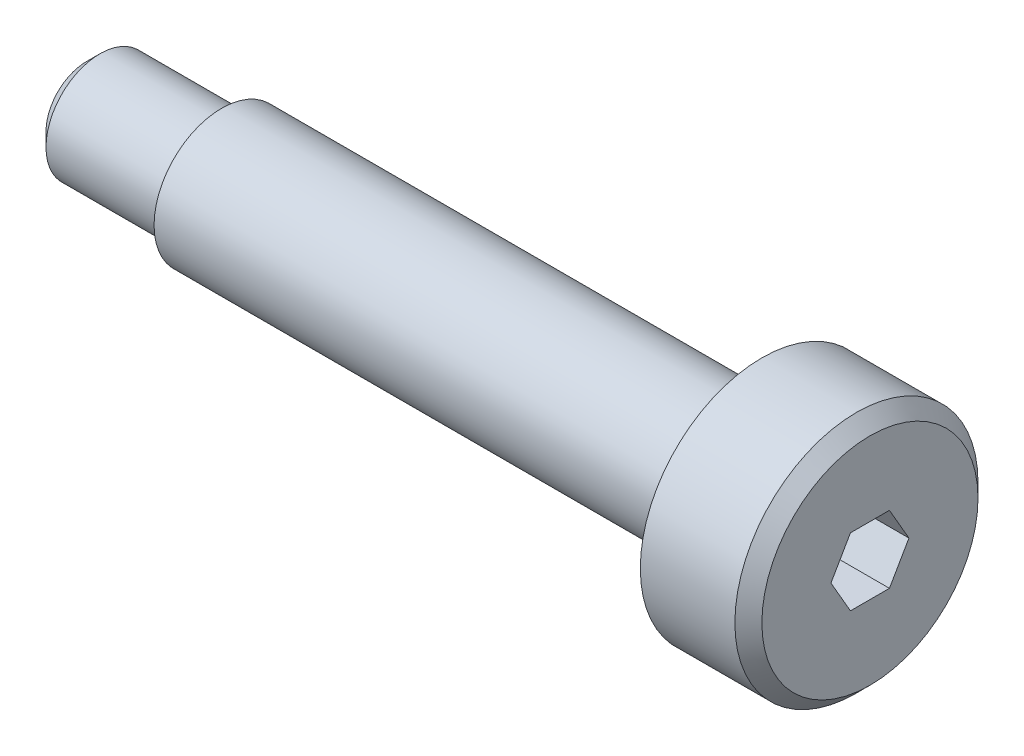
ISO-10303-21;
HEADER;
FILE_DESCRIPTION(('STEP AP214'),'2;1');
FILE_NAME('part.step','',(''),(''),'','','');
FILE_SCHEMA(('AUTOMOTIVE_DESIGN { 1 0 10303 214 1 1 1 1 }'));
ENDSEC;
DATA;
#1=APPLICATION_CONTEXT('core data for automotive mechanical design processes');
#2=APPLICATION_PROTOCOL_DEFINITION('international standard','automotive_design',2000,#1);
#3=PRODUCT_CONTEXT('',#1,'mechanical');
#4=PRODUCT('Part','Part','',(#3));
#5=PRODUCT_RELATED_PRODUCT_CATEGORY('part','',(#4));
#6=PRODUCT_DEFINITION_FORMATION('','',#4);
#7=PRODUCT_DEFINITION_CONTEXT('part definition',#1,'design');
#8=PRODUCT_DEFINITION('design','',#6,#7);
#9=PRODUCT_DEFINITION_SHAPE('','',#8);
#10=(LENGTH_UNIT() NAMED_UNIT(*) SI_UNIT(.MILLI.,.METRE.));
#11=(NAMED_UNIT(*) PLANE_ANGLE_UNIT() SI_UNIT($,.RADIAN.));
#12=(NAMED_UNIT(*) SI_UNIT($,.STERADIAN.) SOLID_ANGLE_UNIT());
#13=UNCERTAINTY_MEASURE_WITH_UNIT(LENGTH_MEASURE(1.E-05),#10,'distance_accuracy_value','');
#14=(GEOMETRIC_REPRESENTATION_CONTEXT(3) GLOBAL_UNCERTAINTY_ASSIGNED_CONTEXT((#13)) GLOBAL_UNIT_ASSIGNED_CONTEXT((#10,
#11,#12)) REPRESENTATION_CONTEXT('',''));
#15=CARTESIAN_POINT('',(0.,0.,0.));
#16=DIRECTION('',(0.,0.,1.));
#17=DIRECTION('',(1.,0.,0.));
#18=AXIS2_PLACEMENT_3D('',#15,#16,#17);
#19=CARTESIAN_POINT('',(0.,1.5,0.));
#20=DIRECTION('',(1.,0.,0.));
#21=DIRECTION('',(0.,0.,-1.));
#22=AXIS2_PLACEMENT_3D('',#19,#20,#21);
#23=PLANE('',#22);
#24=CARTESIAN_POINT('',(0.,0.,0.));
#25=DIRECTION('',(-1.,0.,0.));
#26=DIRECTION('',(0.,0.,1.));
#27=AXIS2_PLACEMENT_3D('',#24,#25,#26);
#28=CIRCLE('',#27,1.5);
#29=CARTESIAN_POINT('',(0.,0.,1.5));
#30=VERTEX_POINT('',#29);
#31=EDGE_CURVE('E159',#30,#30,#28,.T.);
#32=ORIENTED_EDGE('',*,*,#31,.T.);
#33=EDGE_LOOP('',(#32));
#34=FACE_BOUND('',#33,.T.);
#35=ADVANCED_FACE('F45',(#34),#23,.F.);
#36=CARTESIAN_POINT('',(29.,0.,0.));
#37=DIRECTION('',(-1.,0.,0.));
#38=DIRECTION('',(0.,0.,1.));
#39=AXIS2_PLACEMENT_3D('',#36,#37,#38);
#40=PLANE('',#39);
#41=DIRECTION('',(0.,0.866025403784438,0.5));
#42=VECTOR('',#41,1.);
#43=CARTESIAN_POINT('',(29.,0.,-1.44337567297407));
#44=LINE('',#43,#42);
#45=CARTESIAN_POINT('',(29.,0.,-1.44337567297407));
#46=VERTEX_POINT('',#45);
#47=CARTESIAN_POINT('',(29.,1.25,-0.721687836487032));
#48=VERTEX_POINT('',#47);
#49=EDGE_CURVE('E140',#46,#48,#44,.T.);
#50=ORIENTED_EDGE('',*,*,#49,.F.);
#51=DIRECTION('',(0.,0.866025403784439,-0.5));
#52=VECTOR('',#51,1.);
#53=CARTESIAN_POINT('',(29.,-1.25,-0.721687836487033));
#54=LINE('',#53,#52);
#55=CARTESIAN_POINT('',(29.,-1.25,-0.721687836487033));
#56=VERTEX_POINT('',#55);
#57=EDGE_CURVE('E60',#56,#46,#54,.T.);
#58=ORIENTED_EDGE('',*,*,#57,.F.);
#59=DIRECTION('',(0.,0.,-1.));
#60=VECTOR('',#59,1.);
#61=CARTESIAN_POINT('',(29.,-1.25,0.721687836487031));
#62=LINE('',#61,#60);
#63=CARTESIAN_POINT('',(29.,-1.25,0.721687836487031));
#64=VERTEX_POINT('',#63);
#65=EDGE_CURVE('E153',#64,#56,#62,.T.);
#66=ORIENTED_EDGE('',*,*,#65,.F.);
#67=DIRECTION('',(0.,-0.866025403784438,-0.5));
#68=VECTOR('',#67,1.);
#69=CARTESIAN_POINT('',(29.,0.,1.44337567297406));
#70=LINE('',#69,#68);
#71=CARTESIAN_POINT('',(29.,0.,1.44337567297406));
#72=VERTEX_POINT('',#71);
#73=EDGE_CURVE('E150',#72,#64,#70,.T.);
#74=ORIENTED_EDGE('',*,*,#73,.F.);
#75=DIRECTION('',(0.,-0.866025403784438,0.5));
#76=VECTOR('',#75,1.);
#77=CARTESIAN_POINT('',(29.,1.25,0.721687836487031));
#78=LINE('',#77,#76);
#79=CARTESIAN_POINT('',(29.,1.25,0.721687836487031));
#80=VERTEX_POINT('',#79);
#81=EDGE_CURVE('E108',#80,#72,#78,.T.);
#82=ORIENTED_EDGE('',*,*,#81,.F.);
#83=DIRECTION('',(0.,0.,1.));
#84=VECTOR('',#83,1.);
#85=CARTESIAN_POINT('',(29.,1.25,-0.721687836487032));
#86=LINE('',#85,#84);
#87=EDGE_CURVE('E144',#48,#80,#86,.T.);
#88=ORIENTED_EDGE('',*,*,#87,.F.);
#89=EDGE_LOOP('',(#50,#58,#66,#74,#82,#88));
#90=FACE_BOUND('',#89,.T.);
#91=CARTESIAN_POINT('',(29.,0.,0.));
#92=DIRECTION('',(-1.,0.,0.));
#93=DIRECTION('',(0.,0.,1.));
#94=AXIS2_PLACEMENT_3D('',#91,#92,#93);
#95=CIRCLE('',#94,4.);
#96=CARTESIAN_POINT('',(29.,0.,4.));
#97=VERTEX_POINT('',#96);
#98=EDGE_CURVE('E11',#97,#97,#95,.T.);
#99=ORIENTED_EDGE('',*,*,#98,.F.);
#100=EDGE_LOOP('',(#99));
#101=FACE_BOUND('',#100,.T.);
#102=ADVANCED_FACE('F200',(#90,#101),#40,.F.);
#103=CARTESIAN_POINT('',(29.,0.,0.));
#104=DIRECTION('',(-1.,0.,0.));
#105=DIRECTION('',(0.,0.,1.));
#106=AXIS2_PLACEMENT_3D('',#103,#104,#105);
#107=CONICAL_SURFACE('',#106,4.,0.785398163397451);
#108=CARTESIAN_POINT('',(28.5,0.,0.));
#109=DIRECTION('',(-1.,0.,0.));
#110=DIRECTION('',(0.,0.,1.));
#111=AXIS2_PLACEMENT_3D('',#108,#109,#110);
#112=CIRCLE('',#111,4.5);
#113=CARTESIAN_POINT('',(28.5,0.,4.5));
#114=VERTEX_POINT('',#113);
#115=EDGE_CURVE('E53',#114,#114,#112,.T.);
#116=ORIENTED_EDGE('',*,*,#115,.F.);
#117=EDGE_LOOP('',(#116));
#118=FACE_BOUND('',#117,.T.);
#119=ORIENTED_EDGE('',*,*,#98,.T.);
#120=EDGE_LOOP('',(#119));
#121=FACE_BOUND('',#120,.T.);
#122=ADVANCED_FACE('F197',(#118,#121),#107,.T.);
#123=CARTESIAN_POINT('',(0.,0.,0.));
#124=DIRECTION('',(-1.,0.,0.));
#125=DIRECTION('',(0.,0.,1.));
#126=AXIS2_PLACEMENT_3D('',#123,#124,#125);
#127=CYLINDRICAL_SURFACE('',#126,4.5);
#128=CARTESIAN_POINT('',(25.,0.,0.));
#129=DIRECTION('',(-1.,0.,0.));
#130=DIRECTION('',(0.,0.,1.));
#131=AXIS2_PLACEMENT_3D('',#128,#129,#130);
#132=CIRCLE('',#131,4.5);
#133=CARTESIAN_POINT('',(25.,0.,4.5));
#134=VERTEX_POINT('',#133);
#135=EDGE_CURVE('E188',#134,#134,#132,.T.);
#136=ORIENTED_EDGE('',*,*,#135,.F.);
#137=EDGE_LOOP('',(#136));
#138=FACE_BOUND('',#137,.T.);
#139=ORIENTED_EDGE('',*,*,#115,.T.);
#140=EDGE_LOOP('',(#139));
#141=FACE_BOUND('',#140,.T.);
#142=ADVANCED_FACE('F195',(#138,#141),#127,.T.);
#143=CARTESIAN_POINT('',(25.,4.5,0.));
#144=DIRECTION('',(1.,0.,0.));
#145=DIRECTION('',(0.,0.,-1.));
#146=AXIS2_PLACEMENT_3D('',#143,#144,#145);
#147=PLANE('',#146);
#148=CARTESIAN_POINT('',(25.,0.,0.));
#149=DIRECTION('',(-1.,0.,0.));
#150=DIRECTION('',(0.,0.,1.));
#151=AXIS2_PLACEMENT_3D('',#148,#149,#150);
#152=CIRCLE('',#151,2.5);
#153=CARTESIAN_POINT('',(25.,0.,2.5));
#154=VERTEX_POINT('',#153);
#155=EDGE_CURVE('E184',#154,#154,#152,.T.);
#156=ORIENTED_EDGE('',*,*,#155,.F.);
#157=EDGE_LOOP('',(#156));
#158=FACE_BOUND('',#157,.T.);
#159=ORIENTED_EDGE('',*,*,#135,.T.);
#160=EDGE_LOOP('',(#159));
#161=FACE_BOUND('',#160,.T.);
#162=ADVANCED_FACE('F216',(#158,#161),#147,.F.);
#163=CARTESIAN_POINT('',(0.,0.,0.));
#164=DIRECTION('',(-1.,0.,0.));
#165=DIRECTION('',(0.,0.,1.));
#166=AXIS2_PLACEMENT_3D('',#163,#164,#165);
#167=CYLINDRICAL_SURFACE('',#166,2.5);
#168=CARTESIAN_POINT('',(5.,0.,0.));
#169=DIRECTION('',(-1.,0.,0.));
#170=DIRECTION('',(0.,0.,1.));
#171=AXIS2_PLACEMENT_3D('',#168,#169,#170);
#172=CIRCLE('',#171,2.5);
#173=CARTESIAN_POINT('',(5.,0.,2.5));
#174=VERTEX_POINT('',#173);
#175=EDGE_CURVE('E180',#174,#174,#172,.T.);
#176=ORIENTED_EDGE('',*,*,#175,.F.);
#177=EDGE_LOOP('',(#176));
#178=FACE_BOUND('',#177,.T.);
#179=ORIENTED_EDGE('',*,*,#155,.T.);
#180=EDGE_LOOP('',(#179));
#181=FACE_BOUND('',#180,.T.);
#182=ADVANCED_FACE('F220',(#178,#181),#167,.T.);
#183=CARTESIAN_POINT('',(5.,2.5,0.));
#184=DIRECTION('',(1.,0.,0.));
#185=DIRECTION('',(0.,0.,-1.));
#186=AXIS2_PLACEMENT_3D('',#183,#184,#185);
#187=PLANE('',#186);
#188=CARTESIAN_POINT('',(5.,0.,0.));
#189=DIRECTION('',(-1.,0.,0.));
#190=DIRECTION('',(0.,0.,1.));
#191=AXIS2_PLACEMENT_3D('',#188,#189,#190);
#192=CIRCLE('',#191,2.);
#193=CARTESIAN_POINT('',(5.,0.,2.));
#194=VERTEX_POINT('',#193);
#195=EDGE_CURVE('E176',#194,#194,#192,.T.);
#196=ORIENTED_EDGE('',*,*,#195,.F.);
#197=EDGE_LOOP('',(#196));
#198=FACE_BOUND('',#197,.T.);
#199=ORIENTED_EDGE('',*,*,#175,.T.);
#200=EDGE_LOOP('',(#199));
#201=FACE_BOUND('',#200,.T.);
#202=ADVANCED_FACE('F224',(#198,#201),#187,.F.);
#203=CARTESIAN_POINT('',(0.,0.,0.));
#204=DIRECTION('',(-1.,0.,0.));
#205=DIRECTION('',(0.,0.,1.));
#206=AXIS2_PLACEMENT_3D('',#203,#204,#205);
#207=CYLINDRICAL_SURFACE('',#206,2.);
#208=CARTESIAN_POINT('',(0.5,0.,0.));
#209=DIRECTION('',(-1.,0.,0.));
#210=DIRECTION('',(0.,0.,1.));
#211=AXIS2_PLACEMENT_3D('',#208,#209,#210);
#212=CIRCLE('',#211,2.);
#213=CARTESIAN_POINT('',(0.5,0.,2.));
#214=VERTEX_POINT('',#213);
#215=EDGE_CURVE('E172',#214,#214,#212,.T.);
#216=ORIENTED_EDGE('',*,*,#215,.F.);
#217=EDGE_LOOP('',(#216));
#218=FACE_BOUND('',#217,.T.);
#219=ORIENTED_EDGE('',*,*,#195,.T.);
#220=EDGE_LOOP('',(#219));
#221=FACE_BOUND('',#220,.T.);
#222=ADVANCED_FACE('F228',(#218,#221),#207,.T.);
#223=CARTESIAN_POINT('',(0.5,0.,0.));
#224=DIRECTION('',(1.,0.,0.));
#225=DIRECTION('',(0.,0.,-1.));
#226=AXIS2_PLACEMENT_3D('',#223,#224,#225);
#227=CONICAL_SURFACE('',#226,2.,0.785398163397448);
#228=ORIENTED_EDGE('',*,*,#31,.F.);
#229=EDGE_LOOP('',(#228));
#230=FACE_BOUND('',#229,.T.);
#231=ORIENTED_EDGE('',*,*,#215,.T.);
#232=EDGE_LOOP('',(#231));
#233=FACE_BOUND('',#232,.T.);
#234=ADVANCED_FACE('F232',(#230,#233),#227,.T.);
#235=CARTESIAN_POINT('',(25.,-1.25,-0.721687836487033));
#236=DIRECTION('',(0.,-0.5,-0.866025403784439));
#237=DIRECTION('',(0.,0.866025403784439,-0.5));
#238=AXIS2_PLACEMENT_3D('',#235,#236,#237);
#239=PLANE('',#238);
#240=ORIENTED_EDGE('',*,*,#57,.T.);
#241=DIRECTION('',(1.,0.,0.));
#242=VECTOR('',#241,1.);
#243=CARTESIAN_POINT('',(25.,0.,-1.44337567297407));
#244=LINE('',#243,#242);
#245=CARTESIAN_POINT('',(25.,0.,-1.44337567297407));
#246=VERTEX_POINT('',#245);
#247=EDGE_CURVE('E90',#246,#46,#244,.T.);
#248=ORIENTED_EDGE('',*,*,#247,.F.);
#249=DIRECTION('',(0.,0.866025403784439,-0.5));
#250=VECTOR('',#249,1.);
#251=CARTESIAN_POINT('',(25.,-1.25,-0.721687836487033));
#252=LINE('',#251,#250);
#253=CARTESIAN_POINT('',(25.,-1.25,-0.721687836487033));
#254=VERTEX_POINT('',#253);
#255=EDGE_CURVE('E156',#254,#246,#252,.T.);
#256=ORIENTED_EDGE('',*,*,#255,.F.);
#257=DIRECTION('',(1.,0.,0.));
#258=VECTOR('',#257,1.);
#259=CARTESIAN_POINT('',(25.,-1.25,-0.721687836487033));
#260=LINE('',#259,#258);
#261=EDGE_CURVE('E68',#254,#56,#260,.T.);
#262=ORIENTED_EDGE('',*,*,#261,.T.);
#263=EDGE_LOOP('',(#240,#248,#256,#262));
#264=FACE_BOUND('',#263,.T.);
#265=ADVANCED_FACE('F235',(#264),#239,.F.);
#266=CARTESIAN_POINT('',(25.,-1.25,0.721687836487031));
#267=DIRECTION('',(0.,-1.,0.));
#268=DIRECTION('',(0.,0.,-1.));
#269=AXIS2_PLACEMENT_3D('',#266,#267,#268);
#270=PLANE('',#269);
#271=ORIENTED_EDGE('',*,*,#65,.T.);
#272=ORIENTED_EDGE('',*,*,#261,.F.);
#273=DIRECTION('',(0.,0.,-1.));
#274=VECTOR('',#273,1.);
#275=CARTESIAN_POINT('',(25.,-1.25,0.721687836487031));
#276=LINE('',#275,#274);
#277=CARTESIAN_POINT('',(25.,-1.25,0.721687836487031));
#278=VERTEX_POINT('',#277);
#279=EDGE_CURVE('E122',#278,#254,#276,.T.);
#280=ORIENTED_EDGE('',*,*,#279,.F.);
#281=DIRECTION('',(1.,0.,0.));
#282=VECTOR('',#281,1.);
#283=CARTESIAN_POINT('',(25.,-1.25,0.721687836487031));
#284=LINE('',#283,#282);
#285=EDGE_CURVE('E113',#278,#64,#284,.T.);
#286=ORIENTED_EDGE('',*,*,#285,.T.);
#287=EDGE_LOOP('',(#271,#272,#280,#286));
#288=FACE_BOUND('',#287,.T.);
#289=ADVANCED_FACE('F238',(#288),#270,.F.);
#290=CARTESIAN_POINT('',(25.,0.,1.44337567297406));
#291=DIRECTION('',(0.,-0.5,0.866025403784438));
#292=DIRECTION('',(0.,-0.866025403784438,-0.5));
#293=AXIS2_PLACEMENT_3D('',#290,#291,#292);
#294=PLANE('',#293);
#295=ORIENTED_EDGE('',*,*,#73,.T.);
#296=ORIENTED_EDGE('',*,*,#285,.F.);
#297=DIRECTION('',(0.,-0.866025403784438,-0.5));
#298=VECTOR('',#297,1.);
#299=CARTESIAN_POINT('',(25.,0.,1.44337567297406));
#300=LINE('',#299,#298);
#301=CARTESIAN_POINT('',(25.,0.,1.44337567297406));
#302=VERTEX_POINT('',#301);
#303=EDGE_CURVE('E117',#302,#278,#300,.T.);
#304=ORIENTED_EDGE('',*,*,#303,.F.);
#305=DIRECTION('',(1.,0.,0.));
#306=VECTOR('',#305,1.);
#307=CARTESIAN_POINT('',(25.,0.,1.44337567297406));
#308=LINE('',#307,#306);
#309=EDGE_CURVE('E101',#302,#72,#308,.T.);
#310=ORIENTED_EDGE('',*,*,#309,.T.);
#311=EDGE_LOOP('',(#295,#296,#304,#310));
#312=FACE_BOUND('',#311,.T.);
#313=ADVANCED_FACE('F118',(#312),#294,.F.);
#314=CARTESIAN_POINT('',(25.,1.25,0.721687836487031));
#315=DIRECTION('',(0.,0.5,0.866025403784439));
#316=DIRECTION('',(0.,-0.866025403784438,0.5));
#317=AXIS2_PLACEMENT_3D('',#314,#315,#316);
#318=PLANE('',#317);
#319=ORIENTED_EDGE('',*,*,#81,.T.);
#320=ORIENTED_EDGE('',*,*,#309,.F.);
#321=DIRECTION('',(0.,-0.866025403784438,0.5));
#322=VECTOR('',#321,1.);
#323=CARTESIAN_POINT('',(25.,1.25,0.721687836487031));
#324=LINE('',#323,#322);
#325=CARTESIAN_POINT('',(25.,1.25,0.721687836487031));
#326=VERTEX_POINT('',#325);
#327=EDGE_CURVE('E105',#326,#302,#324,.T.);
#328=ORIENTED_EDGE('',*,*,#327,.F.);
#329=DIRECTION('',(1.,0.,0.));
#330=VECTOR('',#329,1.);
#331=CARTESIAN_POINT('',(25.,1.25,0.721687836487031));
#332=LINE('',#331,#330);
#333=EDGE_CURVE('E114',#326,#80,#332,.T.);
#334=ORIENTED_EDGE('',*,*,#333,.T.);
#335=EDGE_LOOP('',(#319,#320,#328,#334));
#336=FACE_BOUND('',#335,.T.);
#337=ADVANCED_FACE('F103',(#336),#318,.F.);
#338=CARTESIAN_POINT('',(25.,1.25,-0.721687836487032));
#339=DIRECTION('',(0.,1.,0.));
#340=DIRECTION('',(0.,0.,1.));
#341=AXIS2_PLACEMENT_3D('',#338,#339,#340);
#342=PLANE('',#341);
#343=ORIENTED_EDGE('',*,*,#87,.T.);
#344=ORIENTED_EDGE('',*,*,#333,.F.);
#345=DIRECTION('',(0.,0.,1.));
#346=VECTOR('',#345,1.);
#347=CARTESIAN_POINT('',(25.,1.25,-0.721687836487032));
#348=LINE('',#347,#346);
#349=CARTESIAN_POINT('',(25.,1.25,-0.721687836487032));
#350=VERTEX_POINT('',#349);
#351=EDGE_CURVE('E128',#350,#326,#348,.T.);
#352=ORIENTED_EDGE('',*,*,#351,.F.);
#353=DIRECTION('',(1.,0.,0.));
#354=VECTOR('',#353,1.);
#355=CARTESIAN_POINT('',(25.,1.25,-0.721687836487032));
#356=LINE('',#355,#354);
#357=EDGE_CURVE('E164',#350,#48,#356,.T.);
#358=ORIENTED_EDGE('',*,*,#357,.T.);
#359=EDGE_LOOP('',(#343,#344,#352,#358));
#360=FACE_BOUND('',#359,.T.);
#361=ADVANCED_FACE('F242',(#360),#342,.F.);
#362=CARTESIAN_POINT('',(25.,0.,-1.44337567297407));
#363=DIRECTION('',(0.,0.5,-0.866025403784438));
#364=DIRECTION('',(0.,0.866025403784438,0.5));
#365=AXIS2_PLACEMENT_3D('',#362,#363,#364);
#366=PLANE('',#365);
#367=ORIENTED_EDGE('',*,*,#49,.T.);
#368=ORIENTED_EDGE('',*,*,#357,.F.);
#369=DIRECTION('',(0.,0.866025403784438,0.5));
#370=VECTOR('',#369,1.);
#371=CARTESIAN_POINT('',(25.,0.,-1.44337567297407));
#372=LINE('',#371,#370);
#373=EDGE_CURVE('E132',#246,#350,#372,.T.);
#374=ORIENTED_EDGE('',*,*,#373,.F.);
#375=ORIENTED_EDGE('',*,*,#247,.T.);
#376=EDGE_LOOP('',(#367,#368,#374,#375));
#377=FACE_BOUND('',#376,.T.);
#378=ADVANCED_FACE('F239',(#377),#366,.F.);
#379=CARTESIAN_POINT('',(25.,0.,0.));
#380=DIRECTION('',(1.,0.,0.));
#381=DIRECTION('',(0.,0.,-1.));
#382=AXIS2_PLACEMENT_3D('',#379,#380,#381);
#383=PLANE('',#382);
#384=ORIENTED_EDGE('',*,*,#255,.T.);
#385=ORIENTED_EDGE('',*,*,#373,.T.);
#386=ORIENTED_EDGE('',*,*,#351,.T.);
#387=ORIENTED_EDGE('',*,*,#327,.T.);
#388=ORIENTED_EDGE('',*,*,#303,.T.);
#389=ORIENTED_EDGE('',*,*,#279,.T.);
#390=EDGE_LOOP('',(#384,#385,#386,#387,#388,#389));
#391=FACE_BOUND('',#390,.T.);
#392=ADVANCED_FACE('F125',(#391),#383,.T.);
#393=CLOSED_SHELL('',(#35,#102,#122,#142,#162,#182,#202,#222,#234,#265,#289,#313,#337,#361,#378,#392));
#394=MANIFOLD_SOLID_BREP('B2',#393);
#395=ADVANCED_BREP_SHAPE_REPRESENTATION('',(#18,#394),#14);
#396=SHAPE_DEFINITION_REPRESENTATION(#9,#395);
ENDSEC;
END-ISO-10303-21;
